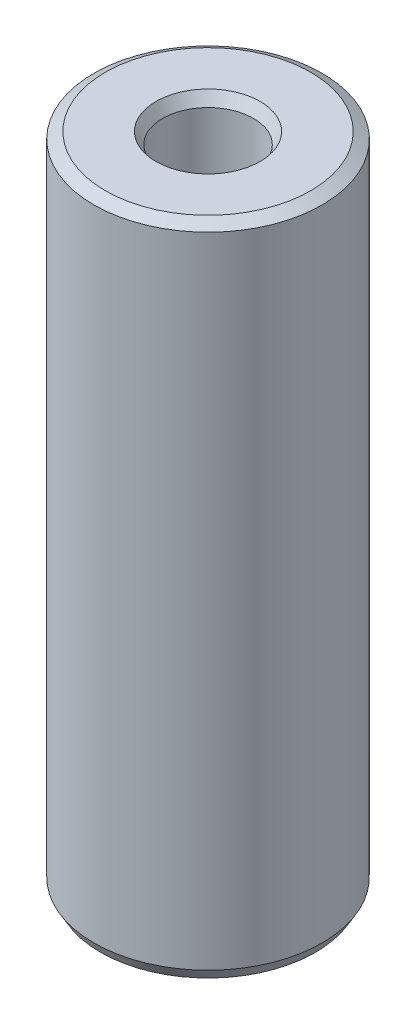
ISO-10303-21;
HEADER;
FILE_DESCRIPTION(('STEP AP214'),'2;1');
FILE_NAME('part.step','',(''),(''),'','','');
FILE_SCHEMA(('AUTOMOTIVE_DESIGN { 1 0 10303 214 1 1 1 1 }'));
ENDSEC;
DATA;
#1=APPLICATION_CONTEXT('core data for automotive mechanical design processes');
#2=APPLICATION_PROTOCOL_DEFINITION('international standard','automotive_design',2000,#1);
#3=PRODUCT_CONTEXT('',#1,'mechanical');
#4=PRODUCT('Part','Part','',(#3));
#5=PRODUCT_RELATED_PRODUCT_CATEGORY('part','',(#4));
#6=PRODUCT_DEFINITION_FORMATION('','',#4);
#7=PRODUCT_DEFINITION_CONTEXT('part definition',#1,'design');
#8=PRODUCT_DEFINITION('design','',#6,#7);
#9=PRODUCT_DEFINITION_SHAPE('','',#8);
#10=(LENGTH_UNIT() NAMED_UNIT(*) SI_UNIT(.MILLI.,.METRE.));
#11=(NAMED_UNIT(*) PLANE_ANGLE_UNIT() SI_UNIT($,.RADIAN.));
#12=(NAMED_UNIT(*) SI_UNIT($,.STERADIAN.) SOLID_ANGLE_UNIT());
#13=UNCERTAINTY_MEASURE_WITH_UNIT(LENGTH_MEASURE(1.E-05),#10,'distance_accuracy_value','');
#14=(GEOMETRIC_REPRESENTATION_CONTEXT(3) GLOBAL_UNCERTAINTY_ASSIGNED_CONTEXT((#13)) GLOBAL_UNIT_ASSIGNED_CONTEXT((#10,
#11,#12)) REPRESENTATION_CONTEXT('',''));
#15=CARTESIAN_POINT('',(0.,0.,0.));
#16=DIRECTION('',(0.,0.,1.));
#17=DIRECTION('',(1.,0.,0.));
#18=AXIS2_PLACEMENT_3D('',#15,#16,#17);
#19=CARTESIAN_POINT('',(0.,43.2006828253677,0.));
#20=DIRECTION('',(0.,-1.,0.));
#21=DIRECTION('',(0.,0.,-1.));
#22=AXIS2_PLACEMENT_3D('',#19,#20,#21);
#23=CYLINDRICAL_SURFACE('',#22,7.5);
#24=CARTESIAN_POINT('',(0.,0.7506246479397,0.));
#25=DIRECTION('',(0.,1.,0.));
#26=DIRECTION('',(0.,0.,1.));
#27=AXIS2_PLACEMENT_3D('',#24,#25,#26);
#28=CIRCLE('',#27,7.5);
#29=CARTESIAN_POINT('',(0.,0.7506246479397,7.5));
#30=VERTEX_POINT('',#29);
#31=EDGE_CURVE('E10',#30,#30,#28,.T.);
#32=ORIENTED_EDGE('',*,*,#31,.T.);
#33=EDGE_LOOP('',(#32));
#34=FACE_BOUND('',#33,.T.);
#35=CARTESIAN_POINT('',(0.,42.7673094828194,0.));
#36=DIRECTION('',(0.,1.,0.));
#37=DIRECTION('',(0.,0.,1.));
#38=AXIS2_PLACEMENT_3D('',#35,#36,#37);
#39=CIRCLE('',#38,7.5);
#40=CARTESIAN_POINT('',(0.,42.7673094828194,7.5));
#41=VERTEX_POINT('',#40);
#42=EDGE_CURVE('E50',#41,#41,#39,.F.);
#43=ORIENTED_EDGE('',*,*,#42,.T.);
#44=EDGE_LOOP('',(#43));
#45=FACE_BOUND('',#44,.T.);
#46=ADVANCED_FACE('F39',(#34,#45),#23,.T.);
#47=CARTESIAN_POINT('',(0.,43.2006828253677,0.));
#48=DIRECTION('',(0.,1.,0.));
#49=DIRECTION('',(0.,0.,1.));
#50=AXIS2_PLACEMENT_3D('',#47,#48,#49);
#51=PLANE('',#50);
#52=CARTESIAN_POINT('',(0.,43.2006828253677,0.));
#53=DIRECTION('',(0.,1.,0.));
#54=DIRECTION('',(0.,0.,1.));
#55=AXIS2_PLACEMENT_3D('',#52,#53,#54);
#56=CIRCLE('',#55,3.42295732339552);
#57=CARTESIAN_POINT('',(0.,43.2006828253677,3.42295732339552));
#58=VERTEX_POINT('',#57);
#59=EDGE_CURVE('E58',#58,#58,#56,.F.);
#60=ORIENTED_EDGE('',*,*,#59,.T.);
#61=EDGE_LOOP('',(#60));
#62=FACE_BOUND('',#61,.T.);
#63=CARTESIAN_POINT('',(0.,43.2006828253677,0.));
#64=DIRECTION('',(0.,1.,0.));
#65=DIRECTION('',(0.,0.,1.));
#66=AXIS2_PLACEMENT_3D('',#63,#64,#65);
#67=CIRCLE('',#66,6.74937535206031);
#68=CARTESIAN_POINT('',(0.,43.2006828253677,6.74937535206031));
#69=VERTEX_POINT('',#68);
#70=EDGE_CURVE('E61',#69,#69,#67,.T.);
#71=ORIENTED_EDGE('',*,*,#70,.T.);
#72=EDGE_LOOP('',(#71));
#73=FACE_BOUND('',#72,.T.);
#74=ADVANCED_FACE('F88',(#62,#73),#51,.T.);
#75=CARTESIAN_POINT('',(0.,0.,0.));
#76=DIRECTION('',(0.,1.,0.));
#77=DIRECTION('',(0.,0.,1.));
#78=AXIS2_PLACEMENT_3D('',#75,#76,#77);
#79=PLANE('',#78);
#80=CARTESIAN_POINT('',(0.,0.,0.));
#81=DIRECTION('',(0.,1.,0.));
#82=DIRECTION('',(0.,0.,1.));
#83=AXIS2_PLACEMENT_3D('',#80,#81,#82);
#84=CIRCLE('',#83,3.74020862878686);
#85=CARTESIAN_POINT('',(0.,0.,3.74020862878686));
#86=VERTEX_POINT('',#85);
#87=EDGE_CURVE('E51',#86,#86,#84,.T.);
#88=ORIENTED_EDGE('',*,*,#87,.T.);
#89=EDGE_LOOP('',(#88));
#90=FACE_BOUND('',#89,.T.);
#91=CARTESIAN_POINT('',(0.,0.,0.));
#92=DIRECTION('',(0.,1.,0.));
#93=DIRECTION('',(0.,0.,1.));
#94=AXIS2_PLACEMENT_3D('',#91,#92,#93);
#95=CIRCLE('',#94,7.06662665745164);
#96=CARTESIAN_POINT('',(0.,0.,7.06662665745164));
#97=VERTEX_POINT('',#96);
#98=EDGE_CURVE('E54',#97,#97,#95,.F.);
#99=ORIENTED_EDGE('',*,*,#98,.T.);
#100=EDGE_LOOP('',(#99));
#101=FACE_BOUND('',#100,.T.);
#102=ADVANCED_FACE('F83',(#90,#101),#79,.F.);
#103=CARTESIAN_POINT('',(0.,43.2006828253677,0.));
#104=DIRECTION('',(0.,-1.,0.));
#105=DIRECTION('',(0.,0.,-1.));
#106=AXIS2_PLACEMENT_3D('',#103,#104,#105);
#107=CYLINDRICAL_SURFACE('',#106,2.98958398084716);
#108=CARTESIAN_POINT('',(0.,42.450058177428,0.));
#109=DIRECTION('',(0.,1.,0.));
#110=DIRECTION('',(0.,0.,1.));
#111=AXIS2_PLACEMENT_3D('',#108,#109,#110);
#112=CIRCLE('',#111,2.98958398084716);
#113=CARTESIAN_POINT('',(0.,42.450058177428,2.98958398084716));
#114=VERTEX_POINT('',#113);
#115=EDGE_CURVE('E67',#114,#114,#112,.T.);
#116=ORIENTED_EDGE('',*,*,#115,.T.);
#117=EDGE_LOOP('',(#116));
#118=FACE_BOUND('',#117,.T.);
#119=CARTESIAN_POINT('',(0.,0.433373342548359,0.));
#120=DIRECTION('',(0.,1.,0.));
#121=DIRECTION('',(0.,0.,1.));
#122=AXIS2_PLACEMENT_3D('',#119,#120,#121);
#123=CIRCLE('',#122,2.98958398084716);
#124=CARTESIAN_POINT('',(0.,0.433373342548359,2.98958398084716));
#125=VERTEX_POINT('',#124);
#126=EDGE_CURVE('E69',#125,#125,#123,.F.);
#127=ORIENTED_EDGE('',*,*,#126,.T.);
#128=EDGE_LOOP('',(#127));
#129=FACE_BOUND('',#128,.T.);
#130=ADVANCED_FACE('F71',(#118,#129),#107,.F.);
#131=CARTESIAN_POINT('',(0.,42.450058177428,0.));
#132=DIRECTION('',(0.,1.,0.));
#133=DIRECTION('',(0.,0.,1.));
#134=AXIS2_PLACEMENT_3D('',#131,#132,#133);
#135=CONICAL_SURFACE('',#134,2.98958398084716,0.523598775598299);
#136=ORIENTED_EDGE('',*,*,#59,.F.);
#137=EDGE_LOOP('',(#136));
#138=FACE_BOUND('',#137,.T.);
#139=ORIENTED_EDGE('',*,*,#115,.F.);
#140=EDGE_LOOP('',(#139));
#141=FACE_BOUND('',#140,.T.);
#142=ADVANCED_FACE('F77',(#138,#141),#135,.F.);
#143=CARTESIAN_POINT('',(0.,0.,0.));
#144=DIRECTION('',(0.,-1.,0.));
#145=DIRECTION('',(0.,0.,-1.));
#146=AXIS2_PLACEMENT_3D('',#143,#144,#145);
#147=CONICAL_SURFACE('',#146,3.74020862878686,1.0471975511966);
#148=ORIENTED_EDGE('',*,*,#126,.F.);
#149=EDGE_LOOP('',(#148));
#150=FACE_BOUND('',#149,.T.);
#151=ORIENTED_EDGE('',*,*,#87,.F.);
#152=EDGE_LOOP('',(#151));
#153=FACE_BOUND('',#152,.T.);
#154=ADVANCED_FACE('F73',(#150,#153),#147,.F.);
#155=CARTESIAN_POINT('',(0.,0.7506246479397,0.));
#156=DIRECTION('',(0.,1.,0.));
#157=DIRECTION('',(0.,0.,1.));
#158=AXIS2_PLACEMENT_3D('',#155,#156,#157);
#159=CONICAL_SURFACE('',#158,7.5,0.5235987755983);
#160=CARTESIAN_POINT('',(0.,0.,7.06662665745164));
#161=CARTESIAN_POINT('',(0.,0.00781900674937186,7.07114096310319));
#162=CARTESIAN_POINT('',(0.,0.0156380134987437,7.07565526875474));
#163=CARTESIAN_POINT('',(0.,0.0312760269974874,7.08468388005783));
#164=CARTESIAN_POINT('',(0.,0.0390950337468593,7.08919818570937));
#165=CARTESIAN_POINT('',(0.,0.054733047245603,7.09822679701246));
#166=CARTESIAN_POINT('',(0.,0.0625520539949748,7.10274110266401));
#167=CARTESIAN_POINT('',(0.,0.0781900674937186,7.1117697139671));
#168=CARTESIAN_POINT('',(0.,0.0860090742430906,7.11628401961864));
#169=CARTESIAN_POINT('',(0.,0.101647087741834,7.12531263092173));
#170=CARTESIAN_POINT('',(0.,0.109466094491206,7.12982693657328));
#171=CARTESIAN_POINT('',(0.,0.12510410798995,7.13885554787637));
#172=CARTESIAN_POINT('',(0.,0.132923114739322,7.14336985352792));
#173=CARTESIAN_POINT('',(0.,0.148561128238066,7.15239846483101));
#174=CARTESIAN_POINT('',(0.,0.156380134987437,7.15691277048255));
#175=CARTESIAN_POINT('',(0.,0.172018148486181,7.16594138178564));
#176=CARTESIAN_POINT('',(0.,0.179837155235553,7.17045568743719));
#177=CARTESIAN_POINT('',(0.,0.195475168734297,7.17948429874028));
#178=CARTESIAN_POINT('',(0.,0.203294175483669,7.18399860439182));
#179=CARTESIAN_POINT('',(0.,0.218932188982412,7.19302721569492));
#180=CARTESIAN_POINT('',(0.,0.226751195731784,7.19754152134646));
#181=CARTESIAN_POINT('',(0.,0.242389209230528,7.20657013264955));
#182=CARTESIAN_POINT('',(0.,0.2502082159799,7.2110844383011));
#183=CARTESIAN_POINT('',(0.,0.265846229478644,7.22011304960419));
#184=CARTESIAN_POINT('',(0.,0.273665236228016,7.22462735525573));
#185=CARTESIAN_POINT('',(0.,0.289303249726759,7.23365596655882));
#186=CARTESIAN_POINT('',(0.,0.297122256476131,7.23817027221037));
#187=CARTESIAN_POINT('',(0.,0.312760269974875,7.24719888351346));
#188=CARTESIAN_POINT('',(0.,0.320579276724247,7.25171318916501));
#189=CARTESIAN_POINT('',(0.,0.336217290222991,7.2607418004681));
#190=CARTESIAN_POINT('',(0.,0.344036296972363,7.26525610611964));
#191=CARTESIAN_POINT('',(0.,0.359674310471106,7.27428471742273));
#192=CARTESIAN_POINT('',(0.,0.367493317220478,7.27879902307428));
#193=CARTESIAN_POINT('',(0.,0.383131330719222,7.28782763437737));
#194=CARTESIAN_POINT('',(0.,0.390950337468594,7.29234194002891));
#195=CARTESIAN_POINT('',(0.,0.406588350967338,7.301370551332));
#196=CARTESIAN_POINT('',(0.,0.41440735771671,7.30588485698355));
#197=CARTESIAN_POINT('',(0.,0.430045371215453,7.31491346828664));
#198=CARTESIAN_POINT('',(0.,0.437864377964825,7.31942777393818));
#199=CARTESIAN_POINT('',(0.,0.453502391463569,7.32845638524128));
#200=CARTESIAN_POINT('',(0.,0.461321398212941,7.33297069089282));
#201=CARTESIAN_POINT('',(0.,0.476959411711685,7.34199930219591));
#202=CARTESIAN_POINT('',(0.,0.484778418461056,7.34651360784746));
#203=CARTESIAN_POINT('',(0.,0.5004164319598,7.35554221915055));
#204=CARTESIAN_POINT('',(0.,0.508235438709172,7.36005652480209));
#205=CARTESIAN_POINT('',(0.,0.523873452207916,7.36908513610518));
#206=CARTESIAN_POINT('',(0.,0.531692458957288,7.37359944175673));
#207=CARTESIAN_POINT('',(0.,0.547330472456031,7.38262805305982));
#208=CARTESIAN_POINT('',(0.,0.555149479205403,7.38714235871137));
#209=CARTESIAN_POINT('',(0.,0.570787492704147,7.39617097001446));
#210=CARTESIAN_POINT('',(0.,0.578606499453519,7.400685275666));
#211=CARTESIAN_POINT('',(0.,0.594244512952263,7.40971388696909));
#212=CARTESIAN_POINT('',(0.,0.602063519701635,7.41422819262064));
#213=CARTESIAN_POINT('',(0.,0.617701533200378,7.42325680392373));
#214=CARTESIAN_POINT('',(0.,0.62552053994975,7.42777110957527));
#215=CARTESIAN_POINT('',(0.,0.641158553448494,7.43679972087836));
#216=CARTESIAN_POINT('',(0.,0.648977560197866,7.44131402652991));
#217=CARTESIAN_POINT('',(0.,0.66461557369661,7.450342637833));
#218=CARTESIAN_POINT('',(0.,0.672434580445981,7.45485694348455));
#219=CARTESIAN_POINT('',(0.,0.688072593944725,7.46388555478764));
#220=CARTESIAN_POINT('',(0.,0.695891600694097,7.46839986043918));
#221=CARTESIAN_POINT('',(0.,0.711529614192841,7.47742847174227));
#222=CARTESIAN_POINT('',(0.,0.719348620942213,7.48194277739382));
#223=CARTESIAN_POINT('',(0.,0.734986634440957,7.49097138869691));
#224=CARTESIAN_POINT('',(0.,0.742805641190329,7.49548569434845));
#225=CARTESIAN_POINT('',(0.,0.7506246479397,7.5));
#226=B_SPLINE_CURVE_WITH_KNOTS('',3,(#160,#161,#162,#163,#164,#165,#166,#167,#168,#169,#170,
#171,#172,#173,#174,#175,#176,#177,#178,#179,#180,#181,#182,#183,#184,#185,#186,#187,#188,#189,
#190,#191,#192,#193,#194,#195,#196,#197,#198,#199,#200,#201,#202,#203,#204,#205,#206,#207,#208,
#209,#210,#211,#212,#213,#214,#215,#216,#217,#218,#219,#220,#221,#222,#223,#224,#225),
.UNSPECIFIED.,.F.,.F.,(4,2,2,2,2,2,2,2,2,2,2,2,2,2,2,2,2,2,2,2,2,2,2,2,2,2,2,2,2,2,2,2,4),(0.,
0.0270858339092719,0.0541716678185442,0.0812575017278165,0.108343335637088,0.135429169546361,
0.162515003455633,0.189600837364905,0.216686671274177,0.243772505183449,0.270858339092721,
0.297944173001994,0.325030006911266,0.352115840820538,0.37920167472981,0.406287508639082,
0.433373342548354,0.460459176457627,0.487545010366898,0.514630844276171,0.541716678185443,
0.568802512094715,0.595888346003987,0.622974179913259,0.650060013822531,0.677145847731804,
0.704231681641076,0.731317515550348,0.75840334945962,0.785489183368892,0.812575017278164,
0.839660851187436,0.866746685096708),.UNSPECIFIED.);
#227=EDGE_CURVE('BSEAM76',#97,#30,#226,.T.);
#228=ORIENTED_EDGE('',*,*,#98,.F.);
#229=ORIENTED_EDGE('',*,*,#31,.F.);
#230=ORIENTED_EDGE('',*,*,#227,.T.);
#231=ORIENTED_EDGE('',*,*,#227,.F.);
#232=EDGE_LOOP('',(#228,#230,#229,#231));
#233=FACE_BOUND('',#232,.T.);
#234=ADVANCED_FACE('F76',(#233),#159,.T.);
#235=CARTESIAN_POINT('',(0.,43.2006828253677,0.));
#236=DIRECTION('',(0.,-1.,0.));
#237=DIRECTION('',(0.,0.,-1.));
#238=AXIS2_PLACEMENT_3D('',#235,#236,#237);
#239=CONICAL_SURFACE('',#238,6.74937535206031,1.04719755119659);
#240=ORIENTED_EDGE('',*,*,#42,.F.);
#241=EDGE_LOOP('',(#240));
#242=FACE_BOUND('',#241,.T.);
#243=ORIENTED_EDGE('',*,*,#70,.F.);
#244=EDGE_LOOP('',(#243));
#245=FACE_BOUND('',#244,.T.);
#246=ADVANCED_FACE('F45',(#242,#245),#239,.T.);
#247=CLOSED_SHELL('',(#46,#74,#102,#130,#142,#154,#234,#246));
#248=MANIFOLD_SOLID_BREP('B2',#247);
#249=ADVANCED_BREP_SHAPE_REPRESENTATION('',(#18,#248),#14);
#250=SHAPE_DEFINITION_REPRESENTATION(#9,#249);
ENDSEC;
END-ISO-10303-21;
